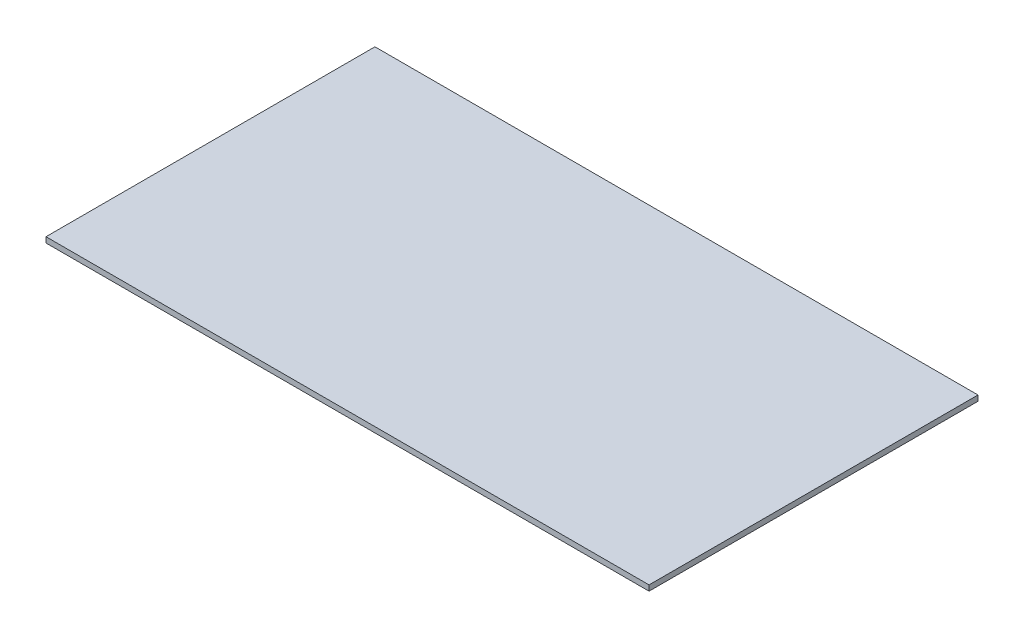
ISO-10303-21;
HEADER;
FILE_DESCRIPTION(('STEP AP214'),'2;1');
FILE_NAME('part.step','',(''),(''),'','','');
FILE_SCHEMA(('AUTOMOTIVE_DESIGN { 1 0 10303 214 1 1 1 1 }'));
ENDSEC;
DATA;
#1=APPLICATION_CONTEXT('core data for automotive mechanical design processes');
#2=APPLICATION_PROTOCOL_DEFINITION('international standard','automotive_design',2000,#1);
#3=PRODUCT_CONTEXT('',#1,'mechanical');
#4=PRODUCT('Part','Part','',(#3));
#5=PRODUCT_RELATED_PRODUCT_CATEGORY('part','',(#4));
#6=PRODUCT_DEFINITION_FORMATION('','',#4);
#7=PRODUCT_DEFINITION_CONTEXT('part definition',#1,'design');
#8=PRODUCT_DEFINITION('design','',#6,#7);
#9=PRODUCT_DEFINITION_SHAPE('','',#8);
#10=(LENGTH_UNIT() NAMED_UNIT(*) SI_UNIT(.MILLI.,.METRE.));
#11=(NAMED_UNIT(*) PLANE_ANGLE_UNIT() SI_UNIT($,.RADIAN.));
#12=(NAMED_UNIT(*) SI_UNIT($,.STERADIAN.) SOLID_ANGLE_UNIT());
#13=UNCERTAINTY_MEASURE_WITH_UNIT(LENGTH_MEASURE(1.E-05),#10,'distance_accuracy_value','');
#14=(GEOMETRIC_REPRESENTATION_CONTEXT(3) GLOBAL_UNCERTAINTY_ASSIGNED_CONTEXT((#13)) GLOBAL_UNIT_ASSIGNED_CONTEXT((#10,
#11,#12)) REPRESENTATION_CONTEXT('',''));
#15=CARTESIAN_POINT('',(0.,0.,0.));
#16=DIRECTION('',(0.,0.,1.));
#17=DIRECTION('',(1.,0.,0.));
#18=AXIS2_PLACEMENT_3D('',#15,#16,#17);
#19=CARTESIAN_POINT('',(275.,5.,150.));
#20=DIRECTION('',(-1.,0.,0.));
#21=DIRECTION('',(0.,0.,1.));
#22=AXIS2_PLACEMENT_3D('',#19,#20,#21);
#23=PLANE('',#22);
#24=DIRECTION('',(0.,0.,-1.));
#25=VECTOR('',#24,1.);
#26=CARTESIAN_POINT('',(275.,0.,150.));
#27=LINE('',#26,#25);
#28=CARTESIAN_POINT('',(275.,0.,150.));
#29=VERTEX_POINT('',#28);
#30=CARTESIAN_POINT('',(275.,0.,-150.));
#31=VERTEX_POINT('',#30);
#32=EDGE_CURVE('E96',#29,#31,#27,.T.);
#33=ORIENTED_EDGE('',*,*,#32,.T.);
#34=DIRECTION('',(0.,-1.,0.));
#35=VECTOR('',#34,1.);
#36=CARTESIAN_POINT('',(275.,5.,-150.));
#37=LINE('',#36,#35);
#38=CARTESIAN_POINT('',(275.,5.,-150.));
#39=VERTEX_POINT('',#38);
#40=EDGE_CURVE('E11',#39,#31,#37,.T.);
#41=ORIENTED_EDGE('',*,*,#40,.F.);
#42=DIRECTION('',(0.,0.,-1.));
#43=VECTOR('',#42,1.);
#44=CARTESIAN_POINT('',(275.,5.,150.));
#45=LINE('',#44,#43);
#46=CARTESIAN_POINT('',(275.,5.,150.));
#47=VERTEX_POINT('',#46);
#48=EDGE_CURVE('E84',#47,#39,#45,.T.);
#49=ORIENTED_EDGE('',*,*,#48,.F.);
#50=DIRECTION('',(0.,-1.,0.));
#51=VECTOR('',#50,1.);
#52=CARTESIAN_POINT('',(275.,5.,150.));
#53=LINE('',#52,#51);
#54=EDGE_CURVE('E92',#47,#29,#53,.T.);
#55=ORIENTED_EDGE('',*,*,#54,.T.);
#56=EDGE_LOOP('',(#33,#41,#49,#55));
#57=FACE_BOUND('',#56,.T.);
#58=ADVANCED_FACE('F33',(#57),#23,.F.);
#59=CARTESIAN_POINT('',(-275.,5.,-150.));
#60=DIRECTION('',(0.,0.,1.));
#61=DIRECTION('',(1.,0.,0.));
#62=AXIS2_PLACEMENT_3D('',#59,#60,#61);
#63=PLANE('',#62);
#64=DIRECTION('',(-1.,0.,0.));
#65=VECTOR('',#64,1.);
#66=CARTESIAN_POINT('',(-275.,0.,-150.));
#67=LINE('',#66,#65);
#68=CARTESIAN_POINT('',(-275.,0.,-150.));
#69=VERTEX_POINT('',#68);
#70=EDGE_CURVE('E88',#31,#69,#67,.T.);
#71=ORIENTED_EDGE('',*,*,#70,.T.);
#72=DIRECTION('',(0.,-1.,0.));
#73=VECTOR('',#72,1.);
#74=CARTESIAN_POINT('',(-275.,5.,-150.));
#75=LINE('',#74,#73);
#76=CARTESIAN_POINT('',(-275.,5.,-150.));
#77=VERTEX_POINT('',#76);
#78=EDGE_CURVE('E41',#77,#69,#75,.T.);
#79=ORIENTED_EDGE('',*,*,#78,.F.);
#80=DIRECTION('',(-1.,0.,0.));
#81=VECTOR('',#80,1.);
#82=CARTESIAN_POINT('',(-275.,5.,-150.));
#83=LINE('',#82,#81);
#84=EDGE_CURVE('E79',#39,#77,#83,.T.);
#85=ORIENTED_EDGE('',*,*,#84,.F.);
#86=ORIENTED_EDGE('',*,*,#40,.T.);
#87=EDGE_LOOP('',(#71,#79,#85,#86));
#88=FACE_BOUND('',#87,.T.);
#89=ADVANCED_FACE('F87',(#88),#63,.F.);
#90=CARTESIAN_POINT('',(-275.,5.,150.));
#91=DIRECTION('',(1.,0.,0.));
#92=DIRECTION('',(0.,0.,-1.));
#93=AXIS2_PLACEMENT_3D('',#90,#91,#92);
#94=PLANE('',#93);
#95=DIRECTION('',(0.,0.,1.));
#96=VECTOR('',#95,1.);
#97=CARTESIAN_POINT('',(-275.,0.,150.));
#98=LINE('',#97,#96);
#99=CARTESIAN_POINT('',(-275.,0.,150.));
#100=VERTEX_POINT('',#99);
#101=EDGE_CURVE('E66',#69,#100,#98,.T.);
#102=ORIENTED_EDGE('',*,*,#101,.T.);
#103=DIRECTION('',(0.,-1.,0.));
#104=VECTOR('',#103,1.);
#105=CARTESIAN_POINT('',(-275.,5.,150.));
#106=LINE('',#105,#104);
#107=CARTESIAN_POINT('',(-275.,5.,150.));
#108=VERTEX_POINT('',#107);
#109=EDGE_CURVE('E89',#108,#100,#106,.T.);
#110=ORIENTED_EDGE('',*,*,#109,.F.);
#111=DIRECTION('',(0.,0.,1.));
#112=VECTOR('',#111,1.);
#113=CARTESIAN_POINT('',(-275.,5.,150.));
#114=LINE('',#113,#112);
#115=EDGE_CURVE('E82',#77,#108,#114,.T.);
#116=ORIENTED_EDGE('',*,*,#115,.F.);
#117=ORIENTED_EDGE('',*,*,#78,.T.);
#118=EDGE_LOOP('',(#102,#110,#116,#117));
#119=FACE_BOUND('',#118,.T.);
#120=ADVANCED_FACE('F90',(#119),#94,.F.);
#121=CARTESIAN_POINT('',(-275.,5.,150.));
#122=DIRECTION('',(0.,0.,-1.));
#123=DIRECTION('',(-1.,0.,0.));
#124=AXIS2_PLACEMENT_3D('',#121,#122,#123);
#125=PLANE('',#124);
#126=DIRECTION('',(1.,0.,0.));
#127=VECTOR('',#126,1.);
#128=CARTESIAN_POINT('',(-275.,0.,150.));
#129=LINE('',#128,#127);
#130=EDGE_CURVE('E72',#100,#29,#129,.T.);
#131=ORIENTED_EDGE('',*,*,#130,.T.);
#132=ORIENTED_EDGE('',*,*,#54,.F.);
#133=DIRECTION('',(1.,0.,0.));
#134=VECTOR('',#133,1.);
#135=CARTESIAN_POINT('',(-275.,5.,150.));
#136=LINE('',#135,#134);
#137=EDGE_CURVE('E49',#108,#47,#136,.T.);
#138=ORIENTED_EDGE('',*,*,#137,.F.);
#139=ORIENTED_EDGE('',*,*,#109,.T.);
#140=EDGE_LOOP('',(#131,#132,#138,#139));
#141=FACE_BOUND('',#140,.T.);
#142=ADVANCED_FACE('F103',(#141),#125,.F.);
#143=CARTESIAN_POINT('',(0.,5.,0.));
#144=DIRECTION('',(0.,-1.,0.));
#145=DIRECTION('',(0.,0.,-1.));
#146=AXIS2_PLACEMENT_3D('',#143,#144,#145);
#147=PLANE('',#146);
#148=ORIENTED_EDGE('',*,*,#48,.T.);
#149=ORIENTED_EDGE('',*,*,#84,.T.);
#150=ORIENTED_EDGE('',*,*,#115,.T.);
#151=ORIENTED_EDGE('',*,*,#137,.T.);
#152=EDGE_LOOP('',(#148,#149,#150,#151));
#153=FACE_BOUND('',#152,.T.);
#154=ADVANCED_FACE('F80',(#153),#147,.F.);
#155=CARTESIAN_POINT('',(0.,0.,0.));
#156=DIRECTION('',(0.,-1.,0.));
#157=DIRECTION('',(0.,0.,-1.));
#158=AXIS2_PLACEMENT_3D('',#155,#156,#157);
#159=PLANE('',#158);
#160=ORIENTED_EDGE('',*,*,#32,.F.);
#161=ORIENTED_EDGE('',*,*,#130,.F.);
#162=ORIENTED_EDGE('',*,*,#101,.F.);
#163=ORIENTED_EDGE('',*,*,#70,.F.);
#164=EDGE_LOOP('',(#160,#161,#162,#163));
#165=FACE_BOUND('',#164,.T.);
#166=ADVANCED_FACE('F106',(#165),#159,.T.);
#167=CLOSED_SHELL('',(#58,#89,#120,#142,#154,#166));
#168=MANIFOLD_SOLID_BREP('B2',#167);
#169=ADVANCED_BREP_SHAPE_REPRESENTATION('',(#18,#168),#14);
#170=SHAPE_DEFINITION_REPRESENTATION(#9,#169);
ENDSEC;
END-ISO-10303-21;
